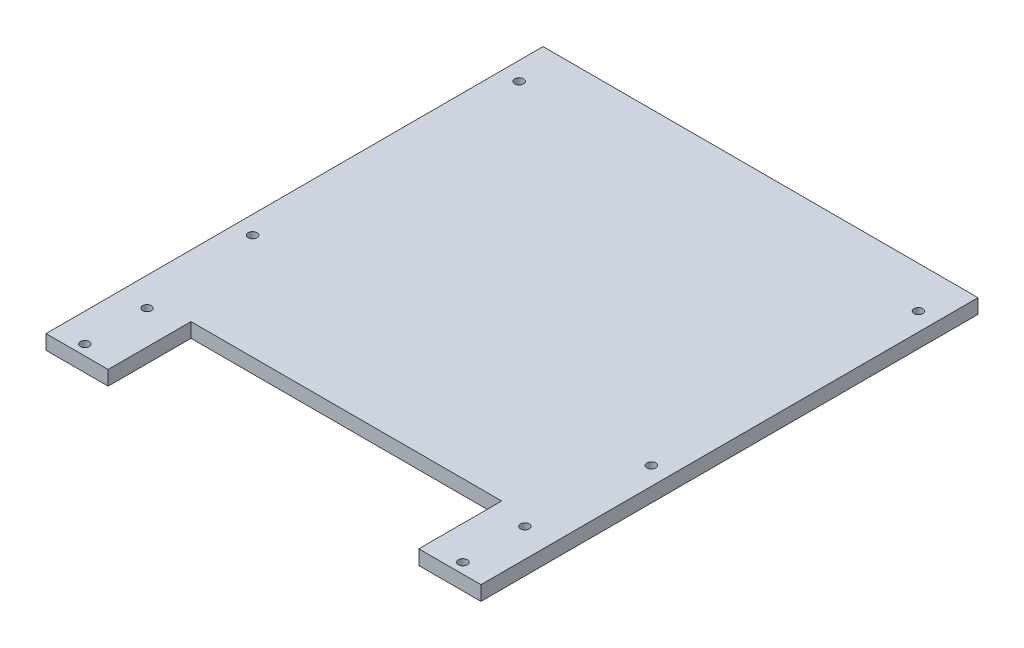
ISO-10303-21;
HEADER;
FILE_DESCRIPTION(('STEP AP214'),'2;1');
FILE_NAME('part.step','',(''),(''),'','','');
FILE_SCHEMA(('AUTOMOTIVE_DESIGN { 1 0 10303 214 1 1 1 1 }'));
ENDSEC;
DATA;
#1=APPLICATION_CONTEXT('core data for automotive mechanical design processes');
#2=APPLICATION_PROTOCOL_DEFINITION('international standard','automotive_design',2000,#1);
#3=PRODUCT_CONTEXT('',#1,'mechanical');
#4=PRODUCT('Part','Part','',(#3));
#5=PRODUCT_RELATED_PRODUCT_CATEGORY('part','',(#4));
#6=PRODUCT_DEFINITION_FORMATION('','',#4);
#7=PRODUCT_DEFINITION_CONTEXT('part definition',#1,'design');
#8=PRODUCT_DEFINITION('design','',#6,#7);
#9=PRODUCT_DEFINITION_SHAPE('','',#8);
#10=(LENGTH_UNIT() NAMED_UNIT(*) SI_UNIT(.MILLI.,.METRE.));
#11=(NAMED_UNIT(*) PLANE_ANGLE_UNIT() SI_UNIT($,.RADIAN.));
#12=(NAMED_UNIT(*) SI_UNIT($,.STERADIAN.) SOLID_ANGLE_UNIT());
#13=UNCERTAINTY_MEASURE_WITH_UNIT(LENGTH_MEASURE(1.E-05),#10,'distance_accuracy_value','');
#14=(GEOMETRIC_REPRESENTATION_CONTEXT(3) GLOBAL_UNCERTAINTY_ASSIGNED_CONTEXT((#13)) GLOBAL_UNIT_ASSIGNED_CONTEXT((#10,
#11,#12)) REPRESENTATION_CONTEXT('',''));
#15=CARTESIAN_POINT('',(0.,0.,0.));
#16=DIRECTION('',(0.,0.,1.));
#17=DIRECTION('',(1.,0.,0.));
#18=AXIS2_PLACEMENT_3D('',#15,#16,#17);
#19=CARTESIAN_POINT('',(210.,14.,240.));
#20=DIRECTION('',(-1.,0.,0.));
#21=DIRECTION('',(0.,0.,1.));
#22=AXIS2_PLACEMENT_3D('',#19,#20,#21);
#23=PLANE('',#22);
#24=DIRECTION('',(0.,0.,-1.));
#25=VECTOR('',#24,1.);
#26=CARTESIAN_POINT('',(210.,0.,240.));
#27=LINE('',#26,#25);
#28=CARTESIAN_POINT('',(210.,0.,240.));
#29=VERTEX_POINT('',#28);
#30=CARTESIAN_POINT('',(210.,0.,-240.));
#31=VERTEX_POINT('',#30);
#32=EDGE_CURVE('E129',#29,#31,#27,.T.);
#33=ORIENTED_EDGE('',*,*,#32,.T.);
#34=DIRECTION('',(0.,-1.,0.));
#35=VECTOR('',#34,1.);
#36=CARTESIAN_POINT('',(210.,14.,-240.));
#37=LINE('',#36,#35);
#38=CARTESIAN_POINT('',(210.,14.,-240.));
#39=VERTEX_POINT('',#38);
#40=EDGE_CURVE('E11',#39,#31,#37,.T.);
#41=ORIENTED_EDGE('',*,*,#40,.F.);
#42=DIRECTION('',(0.,0.,-1.));
#43=VECTOR('',#42,1.);
#44=CARTESIAN_POINT('',(210.,14.,240.));
#45=LINE('',#44,#43);
#46=CARTESIAN_POINT('',(210.,14.,240.));
#47=VERTEX_POINT('',#46);
#48=EDGE_CURVE('E144',#47,#39,#45,.T.);
#49=ORIENTED_EDGE('',*,*,#48,.F.);
#50=DIRECTION('',(0.,-1.,0.));
#51=VECTOR('',#50,1.);
#52=CARTESIAN_POINT('',(210.,14.,240.));
#53=LINE('',#52,#51);
#54=EDGE_CURVE('E125',#47,#29,#53,.T.);
#55=ORIENTED_EDGE('',*,*,#54,.T.);
#56=EDGE_LOOP('',(#33,#41,#49,#55));
#57=FACE_BOUND('',#56,.T.);
#58=ADVANCED_FACE('F33',(#57),#23,.F.);
#59=CARTESIAN_POINT('',(-210.,14.,-240.));
#60=DIRECTION('',(0.,0.,1.));
#61=DIRECTION('',(1.,0.,0.));
#62=AXIS2_PLACEMENT_3D('',#59,#60,#61);
#63=PLANE('',#62);
#64=DIRECTION('',(-1.,0.,0.));
#65=VECTOR('',#64,1.);
#66=CARTESIAN_POINT('',(-210.,0.,-240.));
#67=LINE('',#66,#65);
#68=CARTESIAN_POINT('',(-210.,0.,-240.));
#69=VERTEX_POINT('',#68);
#70=EDGE_CURVE('E132',#31,#69,#67,.T.);
#71=ORIENTED_EDGE('',*,*,#70,.T.);
#72=DIRECTION('',(0.,-1.,0.));
#73=VECTOR('',#72,1.);
#74=CARTESIAN_POINT('',(-210.,14.,-240.));
#75=LINE('',#74,#73);
#76=CARTESIAN_POINT('',(-210.,14.,-240.));
#77=VERTEX_POINT('',#76);
#78=EDGE_CURVE('E41',#77,#69,#75,.T.);
#79=ORIENTED_EDGE('',*,*,#78,.F.);
#80=DIRECTION('',(-1.,0.,0.));
#81=VECTOR('',#80,1.);
#82=CARTESIAN_POINT('',(-210.,14.,-240.));
#83=LINE('',#82,#81);
#84=EDGE_CURVE('E92',#39,#77,#83,.T.);
#85=ORIENTED_EDGE('',*,*,#84,.F.);
#86=ORIENTED_EDGE('',*,*,#40,.T.);
#87=EDGE_LOOP('',(#71,#79,#85,#86));
#88=FACE_BOUND('',#87,.T.);
#89=ADVANCED_FACE('F268',(#88),#63,.F.);
#90=CARTESIAN_POINT('',(-210.,14.,240.));
#91=DIRECTION('',(1.,0.,0.));
#92=DIRECTION('',(0.,0.,-1.));
#93=AXIS2_PLACEMENT_3D('',#90,#91,#92);
#94=PLANE('',#93);
#95=DIRECTION('',(0.,0.,1.));
#96=VECTOR('',#95,1.);
#97=CARTESIAN_POINT('',(-210.,0.,240.));
#98=LINE('',#97,#96);
#99=CARTESIAN_POINT('',(-210.,0.,240.));
#100=VERTEX_POINT('',#99);
#101=EDGE_CURVE('E135',#69,#100,#98,.T.);
#102=ORIENTED_EDGE('',*,*,#101,.T.);
#103=DIRECTION('',(0.,-1.,0.));
#104=VECTOR('',#103,1.);
#105=CARTESIAN_POINT('',(-210.,14.,240.));
#106=LINE('',#105,#104);
#107=CARTESIAN_POINT('',(-210.,14.,240.));
#108=VERTEX_POINT('',#107);
#109=EDGE_CURVE('E151',#108,#100,#106,.T.);
#110=ORIENTED_EDGE('',*,*,#109,.F.);
#111=DIRECTION('',(0.,0.,1.));
#112=VECTOR('',#111,1.);
#113=CARTESIAN_POINT('',(-210.,14.,240.));
#114=LINE('',#113,#112);
#115=EDGE_CURVE('E159',#77,#108,#114,.T.);
#116=ORIENTED_EDGE('',*,*,#115,.F.);
#117=ORIENTED_EDGE('',*,*,#78,.T.);
#118=EDGE_LOOP('',(#102,#110,#116,#117));
#119=FACE_BOUND('',#118,.T.);
#120=ADVANCED_FACE('F157',(#119),#94,.F.);
#121=CARTESIAN_POINT('',(-210.,14.,240.));
#122=DIRECTION('',(0.,0.,-1.));
#123=DIRECTION('',(-1.,0.,0.));
#124=AXIS2_PLACEMENT_3D('',#121,#122,#123);
#125=PLANE('',#124);
#126=DIRECTION('',(1.,0.,0.));
#127=VECTOR('',#126,1.);
#128=CARTESIAN_POINT('',(-210.,0.,240.));
#129=LINE('',#128,#127);
#130=CARTESIAN_POINT('',(-150.,0.,240.));
#131=VERTEX_POINT('',#130);
#132=EDGE_CURVE('E137',#100,#131,#129,.T.);
#133=ORIENTED_EDGE('',*,*,#132,.T.);
#134=DIRECTION('',(0.,-1.,0.));
#135=VECTOR('',#134,1.);
#136=CARTESIAN_POINT('',(-150.,14.,240.));
#137=LINE('',#136,#135);
#138=CARTESIAN_POINT('',(-150.,14.,240.));
#139=VERTEX_POINT('',#138);
#140=EDGE_CURVE('E148',#139,#131,#137,.T.);
#141=ORIENTED_EDGE('',*,*,#140,.F.);
#142=DIRECTION('',(1.,0.,0.));
#143=VECTOR('',#142,1.);
#144=CARTESIAN_POINT('',(-210.,14.,240.));
#145=LINE('',#144,#143);
#146=EDGE_CURVE('E171',#108,#139,#145,.T.);
#147=ORIENTED_EDGE('',*,*,#146,.F.);
#148=ORIENTED_EDGE('',*,*,#109,.T.);
#149=EDGE_LOOP('',(#133,#141,#147,#148));
#150=FACE_BOUND('',#149,.T.);
#151=ADVANCED_FACE('F167',(#150),#125,.F.);
#152=CARTESIAN_POINT('',(-150.,14.,240.));
#153=DIRECTION('',(-1.,0.,0.));
#154=DIRECTION('',(0.,0.,1.));
#155=AXIS2_PLACEMENT_3D('',#152,#153,#154);
#156=PLANE('',#155);
#157=DIRECTION('',(0.,0.,-1.));
#158=VECTOR('',#157,1.);
#159=CARTESIAN_POINT('',(-150.,0.,240.));
#160=LINE('',#159,#158);
#161=CARTESIAN_POINT('',(-150.,0.,160.));
#162=VERTEX_POINT('',#161);
#163=EDGE_CURVE('E139',#131,#162,#160,.T.);
#164=ORIENTED_EDGE('',*,*,#163,.T.);
#165=DIRECTION('',(0.,-1.,0.));
#166=VECTOR('',#165,1.);
#167=CARTESIAN_POINT('',(-150.,14.,160.));
#168=LINE('',#167,#166);
#169=CARTESIAN_POINT('',(-150.,14.,160.));
#170=VERTEX_POINT('',#169);
#171=EDGE_CURVE('E120',#170,#162,#168,.T.);
#172=ORIENTED_EDGE('',*,*,#171,.F.);
#173=DIRECTION('',(0.,0.,-1.));
#174=VECTOR('',#173,1.);
#175=CARTESIAN_POINT('',(-150.,14.,240.));
#176=LINE('',#175,#174);
#177=EDGE_CURVE('E111',#139,#170,#176,.T.);
#178=ORIENTED_EDGE('',*,*,#177,.F.);
#179=ORIENTED_EDGE('',*,*,#140,.T.);
#180=EDGE_LOOP('',(#164,#172,#178,#179));
#181=FACE_BOUND('',#180,.T.);
#182=ADVANCED_FACE('F170',(#181),#156,.F.);
#183=CARTESIAN_POINT('',(-150.,14.,160.));
#184=DIRECTION('',(0.,0.,-1.));
#185=DIRECTION('',(-1.,0.,0.));
#186=AXIS2_PLACEMENT_3D('',#183,#184,#185);
#187=PLANE('',#186);
#188=DIRECTION('',(1.,0.,0.));
#189=VECTOR('',#188,1.);
#190=CARTESIAN_POINT('',(-150.,0.,160.));
#191=LINE('',#190,#189);
#192=CARTESIAN_POINT('',(150.,0.,160.));
#193=VERTEX_POINT('',#192);
#194=EDGE_CURVE('E119',#162,#193,#191,.T.);
#195=ORIENTED_EDGE('',*,*,#194,.T.);
#196=DIRECTION('',(0.,-1.,0.));
#197=VECTOR('',#196,1.);
#198=CARTESIAN_POINT('',(150.,14.,160.));
#199=LINE('',#198,#197);
#200=CARTESIAN_POINT('',(150.,14.,160.));
#201=VERTEX_POINT('',#200);
#202=EDGE_CURVE('E116',#201,#193,#199,.T.);
#203=ORIENTED_EDGE('',*,*,#202,.F.);
#204=DIRECTION('',(1.,0.,0.));
#205=VECTOR('',#204,1.);
#206=CARTESIAN_POINT('',(-150.,14.,160.));
#207=LINE('',#206,#205);
#208=EDGE_CURVE('E105',#170,#201,#207,.T.);
#209=ORIENTED_EDGE('',*,*,#208,.F.);
#210=ORIENTED_EDGE('',*,*,#171,.T.);
#211=EDGE_LOOP('',(#195,#203,#209,#210));
#212=FACE_BOUND('',#211,.T.);
#213=ADVANCED_FACE('F117',(#212),#187,.F.);
#214=CARTESIAN_POINT('',(150.,14.,240.));
#215=DIRECTION('',(1.,0.,0.));
#216=DIRECTION('',(0.,0.,-1.));
#217=AXIS2_PLACEMENT_3D('',#214,#215,#216);
#218=PLANE('',#217);
#219=DIRECTION('',(0.,0.,1.));
#220=VECTOR('',#219,1.);
#221=CARTESIAN_POINT('',(150.,0.,240.));
#222=LINE('',#221,#220);
#223=CARTESIAN_POINT('',(150.,0.,240.));
#224=VERTEX_POINT('',#223);
#225=EDGE_CURVE('E78',#193,#224,#222,.T.);
#226=ORIENTED_EDGE('',*,*,#225,.T.);
#227=DIRECTION('',(0.,-1.,0.));
#228=VECTOR('',#227,1.);
#229=CARTESIAN_POINT('',(150.,14.,240.));
#230=LINE('',#229,#228);
#231=CARTESIAN_POINT('',(150.,14.,240.));
#232=VERTEX_POINT('',#231);
#233=EDGE_CURVE('E121',#232,#224,#230,.T.);
#234=ORIENTED_EDGE('',*,*,#233,.F.);
#235=DIRECTION('',(0.,0.,1.));
#236=VECTOR('',#235,1.);
#237=CARTESIAN_POINT('',(150.,14.,240.));
#238=LINE('',#237,#236);
#239=EDGE_CURVE('E109',#201,#232,#238,.T.);
#240=ORIENTED_EDGE('',*,*,#239,.F.);
#241=ORIENTED_EDGE('',*,*,#202,.T.);
#242=EDGE_LOOP('',(#226,#234,#240,#241));
#243=FACE_BOUND('',#242,.T.);
#244=ADVANCED_FACE('F123',(#243),#218,.F.);
#245=CARTESIAN_POINT('',(150.,14.,240.));
#246=DIRECTION('',(0.,0.,-1.));
#247=DIRECTION('',(-1.,0.,0.));
#248=AXIS2_PLACEMENT_3D('',#245,#246,#247);
#249=PLANE('',#248);
#250=DIRECTION('',(1.,0.,0.));
#251=VECTOR('',#250,1.);
#252=CARTESIAN_POINT('',(150.,0.,240.));
#253=LINE('',#252,#251);
#254=EDGE_CURVE('E84',#224,#29,#253,.T.);
#255=ORIENTED_EDGE('',*,*,#254,.T.);
#256=ORIENTED_EDGE('',*,*,#54,.F.);
#257=DIRECTION('',(1.,0.,0.));
#258=VECTOR('',#257,1.);
#259=CARTESIAN_POINT('',(150.,14.,240.));
#260=LINE('',#259,#258);
#261=EDGE_CURVE('E49',#232,#47,#260,.T.);
#262=ORIENTED_EDGE('',*,*,#261,.F.);
#263=ORIENTED_EDGE('',*,*,#233,.T.);
#264=EDGE_LOOP('',(#255,#256,#262,#263));
#265=FACE_BOUND('',#264,.T.);
#266=ADVANCED_FACE('F236',(#265),#249,.F.);
#267=CARTESIAN_POINT('',(0.,14.,0.));
#268=DIRECTION('',(0.,-1.,0.));
#269=DIRECTION('',(0.,0.,-1.));
#270=AXIS2_PLACEMENT_3D('',#267,#268,#269);
#271=PLANE('',#270);
#272=CARTESIAN_POINT('',(182.5,14.,230.));
#273=DIRECTION('',(0.,1.,0.));
#274=DIRECTION('',(0.,0.,1.));
#275=AXIS2_PLACEMENT_3D('',#272,#273,#274);
#276=CIRCLE('',#275,4.25000000000001);
#277=CARTESIAN_POINT('',(182.5,14.,234.25));
#278=VERTEX_POINT('',#277);
#279=EDGE_CURVE('E219',#278,#278,#276,.T.);
#280=ORIENTED_EDGE('',*,*,#279,.F.);
#281=EDGE_LOOP('',(#280));
#282=FACE_BOUND('',#281,.T.);
#283=CARTESIAN_POINT('',(182.5,14.,170.));
#284=DIRECTION('',(0.,1.,0.));
#285=DIRECTION('',(0.,0.,1.));
#286=AXIS2_PLACEMENT_3D('',#283,#284,#285);
#287=CIRCLE('',#286,4.25000000000001);
#288=CARTESIAN_POINT('',(182.5,14.,174.25));
#289=VERTEX_POINT('',#288);
#290=EDGE_CURVE('E213',#289,#289,#287,.T.);
#291=ORIENTED_EDGE('',*,*,#290,.F.);
#292=EDGE_LOOP('',(#291));
#293=FACE_BOUND('',#292,.T.);
#294=CARTESIAN_POINT('',(192.5,14.,57.9999999995429));
#295=DIRECTION('',(0.,1.,0.));
#296=DIRECTION('',(0.,0.,1.));
#297=AXIS2_PLACEMENT_3D('',#294,#295,#296);
#298=CIRCLE('',#297,4.25000000000001);
#299=CARTESIAN_POINT('',(192.5,14.,62.2499999995429));
#300=VERTEX_POINT('',#299);
#301=EDGE_CURVE('E207',#300,#300,#298,.T.);
#302=ORIENTED_EDGE('',*,*,#301,.F.);
#303=EDGE_LOOP('',(#302));
#304=FACE_BOUND('',#303,.T.);
#305=CARTESIAN_POINT('',(192.499514398558,14.,-200.));
#306=DIRECTION('',(0.,1.,0.));
#307=DIRECTION('',(0.,0.,1.));
#308=AXIS2_PLACEMENT_3D('',#305,#306,#307);
#309=CIRCLE('',#308,4.25000000000001);
#310=CARTESIAN_POINT('',(192.499514398558,14.,-195.75));
#311=VERTEX_POINT('',#310);
#312=EDGE_CURVE('E201',#311,#311,#309,.T.);
#313=ORIENTED_EDGE('',*,*,#312,.F.);
#314=EDGE_LOOP('',(#313));
#315=FACE_BOUND('',#314,.T.);
#316=CARTESIAN_POINT('',(-192.5,14.,-199.38851584293));
#317=DIRECTION('',(0.,1.,0.));
#318=DIRECTION('',(0.,0.,1.));
#319=AXIS2_PLACEMENT_3D('',#316,#317,#318);
#320=CIRCLE('',#319,4.25000000000001);
#321=CARTESIAN_POINT('',(-192.5,14.,-195.13851584293));
#322=VERTEX_POINT('',#321);
#323=EDGE_CURVE('E195',#322,#322,#320,.T.);
#324=ORIENTED_EDGE('',*,*,#323,.F.);
#325=EDGE_LOOP('',(#324));
#326=FACE_BOUND('',#325,.T.);
#327=CARTESIAN_POINT('',(-192.5,14.,57.9999999995429));
#328=DIRECTION('',(0.,1.,0.));
#329=DIRECTION('',(0.,0.,1.));
#330=AXIS2_PLACEMENT_3D('',#327,#328,#329);
#331=CIRCLE('',#330,4.25000000000001);
#332=CARTESIAN_POINT('',(-192.5,14.,62.2499999995429));
#333=VERTEX_POINT('',#332);
#334=EDGE_CURVE('E189',#333,#333,#331,.T.);
#335=ORIENTED_EDGE('',*,*,#334,.F.);
#336=EDGE_LOOP('',(#335));
#337=FACE_BOUND('',#336,.T.);
#338=CARTESIAN_POINT('',(-182.5,14.,170.000000079977));
#339=DIRECTION('',(0.,1.,0.));
#340=DIRECTION('',(0.,0.,1.));
#341=AXIS2_PLACEMENT_3D('',#338,#339,#340);
#342=CIRCLE('',#341,4.25000000000001);
#343=CARTESIAN_POINT('',(-182.5,14.,174.250000079977));
#344=VERTEX_POINT('',#343);
#345=EDGE_CURVE('E183',#344,#344,#342,.T.);
#346=ORIENTED_EDGE('',*,*,#345,.F.);
#347=EDGE_LOOP('',(#346));
#348=FACE_BOUND('',#347,.T.);
#349=CARTESIAN_POINT('',(-182.5,14.,230.000000079977));
#350=DIRECTION('',(0.,1.,0.));
#351=DIRECTION('',(0.,0.,1.));
#352=AXIS2_PLACEMENT_3D('',#349,#350,#351);
#353=CIRCLE('',#352,4.25000000000001);
#354=CARTESIAN_POINT('',(-182.5,14.,234.250000079977));
#355=VERTEX_POINT('',#354);
#356=EDGE_CURVE('E177',#355,#355,#353,.T.);
#357=ORIENTED_EDGE('',*,*,#356,.F.);
#358=EDGE_LOOP('',(#357));
#359=FACE_BOUND('',#358,.T.);
#360=ORIENTED_EDGE('',*,*,#48,.T.);
#361=ORIENTED_EDGE('',*,*,#84,.T.);
#362=ORIENTED_EDGE('',*,*,#115,.T.);
#363=ORIENTED_EDGE('',*,*,#146,.T.);
#364=ORIENTED_EDGE('',*,*,#177,.T.);
#365=ORIENTED_EDGE('',*,*,#208,.T.);
#366=ORIENTED_EDGE('',*,*,#239,.T.);
#367=ORIENTED_EDGE('',*,*,#261,.T.);
#368=EDGE_LOOP('',(#360,#361,#362,#363,#364,#365,#366,#367));
#369=FACE_BOUND('',#368,.T.);
#370=ADVANCED_FACE('F107',(#282,#293,#304,#315,#326,#337,#348,#359,#369),#271,.F.);
#371=CARTESIAN_POINT('',(0.,0.,0.));
#372=DIRECTION('',(0.,-1.,0.));
#373=DIRECTION('',(0.,0.,-1.));
#374=AXIS2_PLACEMENT_3D('',#371,#372,#373);
#375=PLANE('',#374);
#376=CARTESIAN_POINT('',(182.5,0.,230.));
#377=DIRECTION('',(0.,1.,0.));
#378=DIRECTION('',(0.,0.,1.));
#379=AXIS2_PLACEMENT_3D('',#376,#377,#378);
#380=CIRCLE('',#379,4.25000000000001);
#381=CARTESIAN_POINT('',(182.5,0.,234.25));
#382=VERTEX_POINT('',#381);
#383=EDGE_CURVE('E216',#382,#382,#380,.T.);
#384=ORIENTED_EDGE('',*,*,#383,.T.);
#385=EDGE_LOOP('',(#384));
#386=FACE_BOUND('',#385,.T.);
#387=CARTESIAN_POINT('',(182.5,0.,170.));
#388=DIRECTION('',(0.,1.,0.));
#389=DIRECTION('',(0.,0.,1.));
#390=AXIS2_PLACEMENT_3D('',#387,#388,#389);
#391=CIRCLE('',#390,4.25000000000001);
#392=CARTESIAN_POINT('',(182.5,0.,174.25));
#393=VERTEX_POINT('',#392);
#394=EDGE_CURVE('E210',#393,#393,#391,.T.);
#395=ORIENTED_EDGE('',*,*,#394,.T.);
#396=EDGE_LOOP('',(#395));
#397=FACE_BOUND('',#396,.T.);
#398=CARTESIAN_POINT('',(192.5,0.,57.9999999995429));
#399=DIRECTION('',(0.,1.,0.));
#400=DIRECTION('',(0.,0.,1.));
#401=AXIS2_PLACEMENT_3D('',#398,#399,#400);
#402=CIRCLE('',#401,4.25000000000001);
#403=CARTESIAN_POINT('',(192.5,0.,62.2499999995429));
#404=VERTEX_POINT('',#403);
#405=EDGE_CURVE('E204',#404,#404,#402,.T.);
#406=ORIENTED_EDGE('',*,*,#405,.T.);
#407=EDGE_LOOP('',(#406));
#408=FACE_BOUND('',#407,.T.);
#409=CARTESIAN_POINT('',(192.499514398558,0.,-200.));
#410=DIRECTION('',(0.,1.,0.));
#411=DIRECTION('',(0.,0.,1.));
#412=AXIS2_PLACEMENT_3D('',#409,#410,#411);
#413=CIRCLE('',#412,4.25000000000001);
#414=CARTESIAN_POINT('',(192.499514398558,0.,-195.75));
#415=VERTEX_POINT('',#414);
#416=EDGE_CURVE('E198',#415,#415,#413,.T.);
#417=ORIENTED_EDGE('',*,*,#416,.T.);
#418=EDGE_LOOP('',(#417));
#419=FACE_BOUND('',#418,.T.);
#420=CARTESIAN_POINT('',(-192.5,0.,-199.38851584293));
#421=DIRECTION('',(0.,1.,0.));
#422=DIRECTION('',(0.,0.,1.));
#423=AXIS2_PLACEMENT_3D('',#420,#421,#422);
#424=CIRCLE('',#423,4.25000000000001);
#425=CARTESIAN_POINT('',(-192.5,0.,-195.13851584293));
#426=VERTEX_POINT('',#425);
#427=EDGE_CURVE('E192',#426,#426,#424,.T.);
#428=ORIENTED_EDGE('',*,*,#427,.T.);
#429=EDGE_LOOP('',(#428));
#430=FACE_BOUND('',#429,.T.);
#431=CARTESIAN_POINT('',(-192.5,0.,57.9999999995429));
#432=DIRECTION('',(0.,1.,0.));
#433=DIRECTION('',(0.,0.,1.));
#434=AXIS2_PLACEMENT_3D('',#431,#432,#433);
#435=CIRCLE('',#434,4.25000000000001);
#436=CARTESIAN_POINT('',(-192.5,0.,62.2499999995429));
#437=VERTEX_POINT('',#436);
#438=EDGE_CURVE('E186',#437,#437,#435,.T.);
#439=ORIENTED_EDGE('',*,*,#438,.T.);
#440=EDGE_LOOP('',(#439));
#441=FACE_BOUND('',#440,.T.);
#442=CARTESIAN_POINT('',(-182.5,0.,170.000000079977));
#443=DIRECTION('',(0.,1.,0.));
#444=DIRECTION('',(0.,0.,1.));
#445=AXIS2_PLACEMENT_3D('',#442,#443,#444);
#446=CIRCLE('',#445,4.25000000000001);
#447=CARTESIAN_POINT('',(-182.5,0.,174.250000079977));
#448=VERTEX_POINT('',#447);
#449=EDGE_CURVE('E180',#448,#448,#446,.T.);
#450=ORIENTED_EDGE('',*,*,#449,.T.);
#451=EDGE_LOOP('',(#450));
#452=FACE_BOUND('',#451,.T.);
#453=CARTESIAN_POINT('',(-182.5,0.,230.000000079977));
#454=DIRECTION('',(0.,1.,0.));
#455=DIRECTION('',(0.,0.,1.));
#456=AXIS2_PLACEMENT_3D('',#453,#454,#455);
#457=CIRCLE('',#456,4.25000000000001);
#458=CARTESIAN_POINT('',(-182.5,0.,234.250000079977));
#459=VERTEX_POINT('',#458);
#460=EDGE_CURVE('E133',#459,#459,#457,.T.);
#461=ORIENTED_EDGE('',*,*,#460,.T.);
#462=EDGE_LOOP('',(#461));
#463=FACE_BOUND('',#462,.T.);
#464=ORIENTED_EDGE('',*,*,#32,.F.);
#465=ORIENTED_EDGE('',*,*,#254,.F.);
#466=ORIENTED_EDGE('',*,*,#225,.F.);
#467=ORIENTED_EDGE('',*,*,#194,.F.);
#468=ORIENTED_EDGE('',*,*,#163,.F.);
#469=ORIENTED_EDGE('',*,*,#132,.F.);
#470=ORIENTED_EDGE('',*,*,#101,.F.);
#471=ORIENTED_EDGE('',*,*,#70,.F.);
#472=EDGE_LOOP('',(#464,#465,#466,#467,#468,#469,#470,#471));
#473=FACE_BOUND('',#472,.T.);
#474=ADVANCED_FACE('F163',(#386,#397,#408,#419,#430,#441,#452,#463,#473),#375,.T.);
#475=CARTESIAN_POINT('',(-182.5,0.,230.000000079977));
#476=DIRECTION('',(0.,1.,0.));
#477=DIRECTION('',(0.,0.,1.));
#478=AXIS2_PLACEMENT_3D('',#475,#476,#477);
#479=CYLINDRICAL_SURFACE('',#478,4.25000000000001);
#480=ORIENTED_EDGE('',*,*,#460,.F.);
#481=EDGE_LOOP('',(#480));
#482=FACE_BOUND('',#481,.T.);
#483=ORIENTED_EDGE('',*,*,#356,.T.);
#484=EDGE_LOOP('',(#483));
#485=FACE_BOUND('',#484,.T.);
#486=ADVANCED_FACE('F252',(#482,#485),#479,.F.);
#487=CARTESIAN_POINT('',(-182.5,0.,170.000000079977));
#488=DIRECTION('',(0.,1.,0.));
#489=DIRECTION('',(0.,0.,1.));
#490=AXIS2_PLACEMENT_3D('',#487,#488,#489);
#491=CYLINDRICAL_SURFACE('',#490,4.25000000000001);
#492=ORIENTED_EDGE('',*,*,#449,.F.);
#493=EDGE_LOOP('',(#492));
#494=FACE_BOUND('',#493,.T.);
#495=ORIENTED_EDGE('',*,*,#345,.T.);
#496=EDGE_LOOP('',(#495));
#497=FACE_BOUND('',#496,.T.);
#498=ADVANCED_FACE('F254',(#494,#497),#491,.F.);
#499=CARTESIAN_POINT('',(-192.5,0.,57.9999999995429));
#500=DIRECTION('',(0.,1.,0.));
#501=DIRECTION('',(0.,0.,1.));
#502=AXIS2_PLACEMENT_3D('',#499,#500,#501);
#503=CYLINDRICAL_SURFACE('',#502,4.25000000000001);
#504=ORIENTED_EDGE('',*,*,#438,.F.);
#505=EDGE_LOOP('',(#504));
#506=FACE_BOUND('',#505,.T.);
#507=ORIENTED_EDGE('',*,*,#334,.T.);
#508=EDGE_LOOP('',(#507));
#509=FACE_BOUND('',#508,.T.);
#510=ADVANCED_FACE('F261',(#506,#509),#503,.F.);
#511=CARTESIAN_POINT('',(-192.5,0.,-199.38851584293));
#512=DIRECTION('',(0.,1.,0.));
#513=DIRECTION('',(0.,0.,1.));
#514=AXIS2_PLACEMENT_3D('',#511,#512,#513);
#515=CYLINDRICAL_SURFACE('',#514,4.25000000000001);
#516=ORIENTED_EDGE('',*,*,#427,.F.);
#517=EDGE_LOOP('',(#516));
#518=FACE_BOUND('',#517,.T.);
#519=ORIENTED_EDGE('',*,*,#323,.T.);
#520=EDGE_LOOP('',(#519));
#521=FACE_BOUND('',#520,.T.);
#522=ADVANCED_FACE('F339',(#518,#521),#515,.F.);
#523=CARTESIAN_POINT('',(192.499514398558,0.,-200.));
#524=DIRECTION('',(0.,1.,0.));
#525=DIRECTION('',(0.,0.,1.));
#526=AXIS2_PLACEMENT_3D('',#523,#524,#525);
#527=CYLINDRICAL_SURFACE('',#526,4.25000000000001);
#528=ORIENTED_EDGE('',*,*,#416,.F.);
#529=EDGE_LOOP('',(#528));
#530=FACE_BOUND('',#529,.T.);
#531=ORIENTED_EDGE('',*,*,#312,.T.);
#532=EDGE_LOOP('',(#531));
#533=FACE_BOUND('',#532,.T.);
#534=ADVANCED_FACE('F349',(#530,#533),#527,.F.);
#535=CARTESIAN_POINT('',(192.5,0.,57.9999999995429));
#536=DIRECTION('',(0.,1.,0.));
#537=DIRECTION('',(0.,0.,1.));
#538=AXIS2_PLACEMENT_3D('',#535,#536,#537);
#539=CYLINDRICAL_SURFACE('',#538,4.25000000000001);
#540=ORIENTED_EDGE('',*,*,#405,.F.);
#541=EDGE_LOOP('',(#540));
#542=FACE_BOUND('',#541,.T.);
#543=ORIENTED_EDGE('',*,*,#301,.T.);
#544=EDGE_LOOP('',(#543));
#545=FACE_BOUND('',#544,.T.);
#546=ADVANCED_FACE('F359',(#542,#545),#539,.F.);
#547=CARTESIAN_POINT('',(182.5,0.,170.));
#548=DIRECTION('',(0.,1.,0.));
#549=DIRECTION('',(0.,0.,1.));
#550=AXIS2_PLACEMENT_3D('',#547,#548,#549);
#551=CYLINDRICAL_SURFACE('',#550,4.25000000000001);
#552=ORIENTED_EDGE('',*,*,#394,.F.);
#553=EDGE_LOOP('',(#552));
#554=FACE_BOUND('',#553,.T.);
#555=ORIENTED_EDGE('',*,*,#290,.T.);
#556=EDGE_LOOP('',(#555));
#557=FACE_BOUND('',#556,.T.);
#558=ADVANCED_FACE('F230',(#554,#557),#551,.F.);
#559=CARTESIAN_POINT('',(182.5,0.,230.));
#560=DIRECTION('',(0.,1.,0.));
#561=DIRECTION('',(0.,0.,1.));
#562=AXIS2_PLACEMENT_3D('',#559,#560,#561);
#563=CYLINDRICAL_SURFACE('',#562,4.25000000000001);
#564=ORIENTED_EDGE('',*,*,#383,.F.);
#565=EDGE_LOOP('',(#564));
#566=FACE_BOUND('',#565,.T.);
#567=ORIENTED_EDGE('',*,*,#279,.T.);
#568=EDGE_LOOP('',(#567));
#569=FACE_BOUND('',#568,.T.);
#570=ADVANCED_FACE('F227',(#566,#569),#563,.F.);
#571=CLOSED_SHELL('',(#58,#89,#120,#151,#182,#213,#244,#266,#370,#474,#486,#498,#510,#522,#534,
#546,#558,#570));
#572=MANIFOLD_SOLID_BREP('B2',#571);
#573=ADVANCED_BREP_SHAPE_REPRESENTATION('',(#18,#572),#14);
#574=SHAPE_DEFINITION_REPRESENTATION(#9,#573);
ENDSEC;
END-ISO-10303-21;
